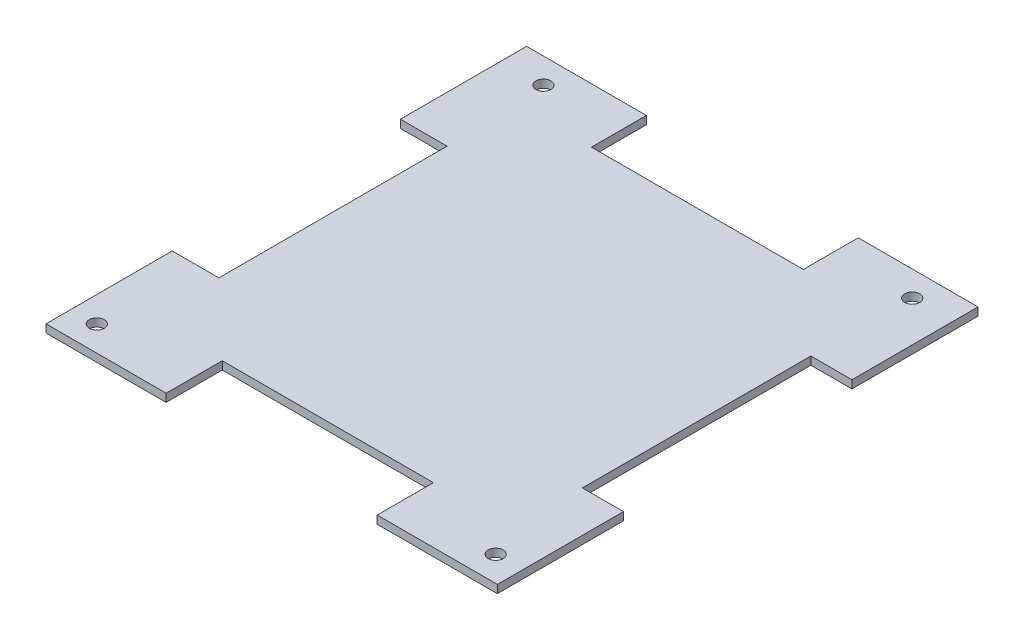
ISO-10303-21;
HEADER;
FILE_DESCRIPTION(('STEP AP214'),'2;1');
FILE_NAME('part.step','',(''),(''),'','','');
FILE_SCHEMA(('AUTOMOTIVE_DESIGN { 1 0 10303 214 1 1 1 1 }'));
ENDSEC;
DATA;
#1=APPLICATION_CONTEXT('core data for automotive mechanical design processes');
#2=APPLICATION_PROTOCOL_DEFINITION('international standard','automotive_design',2000,#1);
#3=PRODUCT_CONTEXT('',#1,'mechanical');
#4=PRODUCT('Part','Part','',(#3));
#5=PRODUCT_RELATED_PRODUCT_CATEGORY('part','',(#4));
#6=PRODUCT_DEFINITION_FORMATION('','',#4);
#7=PRODUCT_DEFINITION_CONTEXT('part definition',#1,'design');
#8=PRODUCT_DEFINITION('design','',#6,#7);
#9=PRODUCT_DEFINITION_SHAPE('','',#8);
#10=(LENGTH_UNIT() NAMED_UNIT(*) SI_UNIT(.MILLI.,.METRE.));
#11=(NAMED_UNIT(*) PLANE_ANGLE_UNIT() SI_UNIT($,.RADIAN.));
#12=(NAMED_UNIT(*) SI_UNIT($,.STERADIAN.) SOLID_ANGLE_UNIT());
#13=UNCERTAINTY_MEASURE_WITH_UNIT(LENGTH_MEASURE(1.E-05),#10,'distance_accuracy_value','');
#14=(GEOMETRIC_REPRESENTATION_CONTEXT(3) GLOBAL_UNCERTAINTY_ASSIGNED_CONTEXT((#13)) GLOBAL_UNIT_ASSIGNED_CONTEXT((#10,
#11,#12)) REPRESENTATION_CONTEXT('',''));
#15=CARTESIAN_POINT('',(0.,0.,0.));
#16=DIRECTION('',(0.,0.,1.));
#17=DIRECTION('',(1.,0.,0.));
#18=AXIS2_PLACEMENT_3D('',#15,#16,#17);
#19=CARTESIAN_POINT('',(0.,0.,2.54));
#20=DIRECTION('',(0.,0.,-1.));
#21=DIRECTION('',(-1.,0.,0.));
#22=AXIS2_PLACEMENT_3D('',#19,#20,#21);
#23=PLANE('',#22);
#24=DIRECTION('',(1.,0.,0.));
#25=VECTOR('',#24,1.);
#26=CARTESIAN_POINT('',(87.45,0.,2.54));
#27=LINE('',#26,#25);
#28=CARTESIAN_POINT('',(-2.59,0.,2.54));
#29=VERTEX_POINT('',#28);
#30=CARTESIAN_POINT('',(21.3706488480498,0.,2.54));
#31=VERTEX_POINT('',#30);
#32=EDGE_CURVE('E273',#29,#31,#27,.T.);
#33=ORIENTED_EDGE('',*,*,#32,.T.);
#34=DIRECTION('',(0.,1.,0.));
#35=VECTOR('',#34,1.);
#36=CARTESIAN_POINT('',(21.3706488480498,0.,2.54));
#37=LINE('',#36,#35);
#38=CARTESIAN_POINT('',(21.3706488480498,1.6,2.54));
#39=VERTEX_POINT('',#38);
#40=EDGE_CURVE('E11',#31,#39,#37,.T.);
#41=ORIENTED_EDGE('',*,*,#40,.T.);
#42=DIRECTION('',(-1.,0.,0.));
#43=VECTOR('',#42,1.);
#44=CARTESIAN_POINT('',(87.45,1.6,2.54));
#45=LINE('',#44,#43);
#46=CARTESIAN_POINT('',(-2.59,1.6,2.54));
#47=VERTEX_POINT('',#46);
#48=EDGE_CURVE('E266',#39,#47,#45,.T.);
#49=ORIENTED_EDGE('',*,*,#48,.T.);
#50=DIRECTION('',(0.,-1.,0.));
#51=VECTOR('',#50,1.);
#52=CARTESIAN_POINT('',(-2.59,1.6,2.54));
#53=LINE('',#52,#51);
#54=EDGE_CURVE('E270',#47,#29,#53,.T.);
#55=ORIENTED_EDGE('',*,*,#54,.T.);
#56=EDGE_LOOP('',(#33,#41,#49,#55));
#57=FACE_BOUND('',#56,.T.);
#58=ADVANCED_FACE('F36',(#57),#23,.F.);
#59=CARTESIAN_POINT('',(-2.59,0.,0.));
#60=DIRECTION('',(1.,0.,0.));
#61=DIRECTION('',(0.,0.,-1.));
#62=AXIS2_PLACEMENT_3D('',#59,#60,#61);
#63=PLANE('',#62);
#64=DIRECTION('',(0.,0.,1.));
#65=VECTOR('',#64,1.);
#66=CARTESIAN_POINT('',(-2.59,0.,-90.8));
#67=LINE('',#66,#65);
#68=CARTESIAN_POINT('',(-2.59,0.,-93.34));
#69=VERTEX_POINT('',#68);
#70=CARTESIAN_POINT('',(-2.59,0.,-68.1600542012034));
#71=VERTEX_POINT('',#70);
#72=EDGE_CURVE('E291',#69,#71,#67,.T.);
#73=ORIENTED_EDGE('',*,*,#72,.T.);
#74=DIRECTION('',(0.,1.,0.));
#75=VECTOR('',#74,1.);
#76=CARTESIAN_POINT('',(-2.59,0.,-68.1600542012034));
#77=LINE('',#76,#75);
#78=CARTESIAN_POINT('',(-2.59,1.6,-68.1600542012034));
#79=VERTEX_POINT('',#78);
#80=EDGE_CURVE('E342',#71,#79,#77,.T.);
#81=ORIENTED_EDGE('',*,*,#80,.T.);
#82=DIRECTION('',(0.,0.,-1.));
#83=VECTOR('',#82,1.);
#84=CARTESIAN_POINT('',(-2.59,1.6,-90.8));
#85=LINE('',#84,#83);
#86=CARTESIAN_POINT('',(-2.59,1.6,-93.34));
#87=VERTEX_POINT('',#86);
#88=EDGE_CURVE('E294',#79,#87,#85,.T.);
#89=ORIENTED_EDGE('',*,*,#88,.T.);
#90=DIRECTION('',(0.,1.,0.));
#91=VECTOR('',#90,1.);
#92=CARTESIAN_POINT('',(-2.59,0.,-93.34));
#93=LINE('',#92,#91);
#94=EDGE_CURVE('E276',#69,#87,#93,.T.);
#95=ORIENTED_EDGE('',*,*,#94,.F.);
#96=EDGE_LOOP('',(#73,#81,#89,#95));
#97=FACE_BOUND('',#96,.T.);
#98=ADVANCED_FACE('F375',(#97),#63,.F.);
#99=CARTESIAN_POINT('',(0.,0.,-93.34));
#100=DIRECTION('',(0.,0.,-1.));
#101=DIRECTION('',(-1.,0.,0.));
#102=AXIS2_PLACEMENT_3D('',#99,#100,#101);
#103=PLANE('',#102);
#104=DIRECTION('',(0.,1.,0.));
#105=VECTOR('',#104,1.);
#106=CARTESIAN_POINT('',(21.2967633827462,0.,-93.34));
#107=LINE('',#106,#105);
#108=CARTESIAN_POINT('',(21.2967633827462,0.,-93.34));
#109=VERTEX_POINT('',#108);
#110=CARTESIAN_POINT('',(21.2967633827462,1.6,-93.34));
#111=VERTEX_POINT('',#110);
#112=EDGE_CURVE('E338',#109,#111,#107,.T.);
#113=ORIENTED_EDGE('',*,*,#112,.F.);
#114=DIRECTION('',(-1.,0.,0.));
#115=VECTOR('',#114,1.);
#116=CARTESIAN_POINT('',(-2.59,0.,-93.34));
#117=LINE('',#116,#115);
#118=EDGE_CURVE('E286',#109,#69,#117,.T.);
#119=ORIENTED_EDGE('',*,*,#118,.T.);
#120=ORIENTED_EDGE('',*,*,#94,.T.);
#121=DIRECTION('',(1.,0.,0.));
#122=VECTOR('',#121,1.);
#123=CARTESIAN_POINT('',(-2.59,1.6,-93.34));
#124=LINE('',#123,#122);
#125=EDGE_CURVE('E280',#87,#111,#124,.T.);
#126=ORIENTED_EDGE('',*,*,#125,.T.);
#127=EDGE_LOOP('',(#113,#119,#120,#126));
#128=FACE_BOUND('',#127,.T.);
#129=ADVANCED_FACE('F379',(#128),#103,.T.);
#130=CARTESIAN_POINT('',(87.45,0.,0.));
#131=DIRECTION('',(-1.,0.,0.));
#132=DIRECTION('',(0.,0.,1.));
#133=AXIS2_PLACEMENT_3D('',#130,#131,#132);
#134=PLANE('',#133);
#135=DIRECTION('',(0.,0.,1.));
#136=VECTOR('',#135,1.);
#137=CARTESIAN_POINT('',(87.45,1.6,-90.8));
#138=LINE('',#137,#136);
#139=CARTESIAN_POINT('',(87.45,1.6,-93.34));
#140=VERTEX_POINT('',#139);
#141=CARTESIAN_POINT('',(87.45,1.6,-68.1857586213216));
#142=VERTEX_POINT('',#141);
#143=EDGE_CURVE('E299',#140,#142,#138,.T.);
#144=ORIENTED_EDGE('',*,*,#143,.T.);
#145=DIRECTION('',(0.,-1.,0.));
#146=VECTOR('',#145,1.);
#147=CARTESIAN_POINT('',(87.45,0.,-68.1857586213216));
#148=LINE('',#147,#146);
#149=CARTESIAN_POINT('',(87.45,0.,-68.1857586213216));
#150=VERTEX_POINT('',#149);
#151=EDGE_CURVE('E333',#142,#150,#148,.T.);
#152=ORIENTED_EDGE('',*,*,#151,.T.);
#153=DIRECTION('',(0.,0.,-1.));
#154=VECTOR('',#153,1.);
#155=CARTESIAN_POINT('',(87.45,0.,-90.8));
#156=LINE('',#155,#154);
#157=CARTESIAN_POINT('',(87.45,0.,-93.34));
#158=VERTEX_POINT('',#157);
#159=EDGE_CURVE('E302',#150,#158,#156,.T.);
#160=ORIENTED_EDGE('',*,*,#159,.T.);
#161=DIRECTION('',(0.,-1.,0.));
#162=VECTOR('',#161,1.);
#163=CARTESIAN_POINT('',(87.45,0.,-93.34));
#164=LINE('',#163,#162);
#165=EDGE_CURVE('E283',#140,#158,#164,.T.);
#166=ORIENTED_EDGE('',*,*,#165,.F.);
#167=EDGE_LOOP('',(#144,#152,#160,#166));
#168=FACE_BOUND('',#167,.T.);
#169=ADVANCED_FACE('F400',(#168),#134,.F.);
#170=CARTESIAN_POINT('',(0.,1.6,0.));
#171=DIRECTION('',(0.,-1.,0.));
#172=DIRECTION('',(0.,0.,-1.));
#173=AXIS2_PLACEMENT_3D('',#170,#171,#172);
#174=PLANE('',#173);
#175=CARTESIAN_POINT('',(79.37,1.6,-88.3));
#176=DIRECTION('',(0.,1.,0.));
#177=DIRECTION('',(0.,0.,1.));
#178=AXIS2_PLACEMENT_3D('',#175,#176,#177);
#179=CIRCLE('',#178,1.5);
#180=CARTESIAN_POINT('',(79.37,1.6,-86.8));
#181=VERTEX_POINT('',#180);
#182=EDGE_CURVE('E306',#181,#181,#179,.T.);
#183=ORIENTED_EDGE('',*,*,#182,.F.);
#184=EDGE_LOOP('',(#183));
#185=FACE_BOUND('',#184,.T.);
#186=CARTESIAN_POINT('',(5.8,1.6,-88.3));
#187=DIRECTION('',(0.,1.,0.));
#188=DIRECTION('',(0.,0.,1.));
#189=AXIS2_PLACEMENT_3D('',#186,#187,#188);
#190=CIRCLE('',#189,1.5);
#191=CARTESIAN_POINT('',(5.8,1.6,-86.8));
#192=VERTEX_POINT('',#191);
#193=EDGE_CURVE('E310',#192,#192,#190,.T.);
#194=ORIENTED_EDGE('',*,*,#193,.F.);
#195=EDGE_LOOP('',(#194));
#196=FACE_BOUND('',#195,.T.);
#197=CARTESIAN_POINT('',(82.07,1.6,-2.5));
#198=DIRECTION('',(0.,1.,0.));
#199=DIRECTION('',(0.,0.,1.));
#200=AXIS2_PLACEMENT_3D('',#197,#198,#199);
#201=CIRCLE('',#200,1.5);
#202=CARTESIAN_POINT('',(82.07,1.6,-1.));
#203=VERTEX_POINT('',#202);
#204=EDGE_CURVE('E316',#203,#203,#201,.T.);
#205=ORIENTED_EDGE('',*,*,#204,.F.);
#206=EDGE_LOOP('',(#205));
#207=FACE_BOUND('',#206,.T.);
#208=CARTESIAN_POINT('',(2.5,1.6,-2.5));
#209=DIRECTION('',(0.,1.,0.));
#210=DIRECTION('',(0.,0.,1.));
#211=AXIS2_PLACEMENT_3D('',#208,#209,#210);
#212=CIRCLE('',#211,1.5);
#213=CARTESIAN_POINT('',(2.5,1.6,-1.));
#214=VERTEX_POINT('',#213);
#215=EDGE_CURVE('E322',#214,#214,#212,.T.);
#216=ORIENTED_EDGE('',*,*,#215,.F.);
#217=EDGE_LOOP('',(#216));
#218=FACE_BOUND('',#217,.T.);
#219=ORIENTED_EDGE('',*,*,#48,.F.);
#220=DIRECTION('',(0.,0.,1.));
#221=VECTOR('',#220,1.);
#222=CARTESIAN_POINT('',(21.3706488480498,1.6,-8.66006941402019));
#223=LINE('',#222,#221);
#224=CARTESIAN_POINT('',(21.3706488480498,1.6,-8.66006941402019));
#225=VERTEX_POINT('',#224);
#226=EDGE_CURVE('E197',#225,#39,#223,.T.);
#227=ORIENTED_EDGE('',*,*,#226,.F.);
#228=DIRECTION('',(-1.,0.,0.));
#229=VECTOR('',#228,1.);
#230=CARTESIAN_POINT('',(63.4893511519502,1.6,-8.6600694140202));
#231=LINE('',#230,#229);
#232=CARTESIAN_POINT('',(63.4893511519502,1.6,-8.6600694140202));
#233=VERTEX_POINT('',#232);
#234=EDGE_CURVE('E194',#233,#225,#231,.T.);
#235=ORIENTED_EDGE('',*,*,#234,.F.);
#236=DIRECTION('',(0.,0.,-1.));
#237=VECTOR('',#236,1.);
#238=CARTESIAN_POINT('',(63.4893511519502,1.6,-8.6600694140202));
#239=LINE('',#238,#237);
#240=CARTESIAN_POINT('',(63.4893511519502,1.6,2.54));
#241=VERTEX_POINT('',#240);
#242=EDGE_CURVE('E175',#241,#233,#239,.T.);
#243=ORIENTED_EDGE('',*,*,#242,.F.);
#244=CARTESIAN_POINT('',(87.45,1.6,2.54));
#245=VERTEX_POINT('',#244);
#246=EDGE_CURVE('E267',#245,#241,#45,.T.);
#247=ORIENTED_EDGE('',*,*,#246,.F.);
#248=CARTESIAN_POINT('',(87.45,1.6,-22.6142413786784));
#249=VERTEX_POINT('',#248);
#250=EDGE_CURVE('E298',#249,#245,#138,.T.);
#251=ORIENTED_EDGE('',*,*,#250,.F.);
#252=DIRECTION('',(1.,0.,0.));
#253=VECTOR('',#252,1.);
#254=CARTESIAN_POINT('',(95.6363214880288,1.6,-22.6142413786784));
#255=LINE('',#254,#253);
#256=CARTESIAN_POINT('',(79.2636785119712,1.6,-22.6142413786784));
#257=VERTEX_POINT('',#256);
#258=EDGE_CURVE('E256',#257,#249,#255,.T.);
#259=ORIENTED_EDGE('',*,*,#258,.F.);
#260=DIRECTION('',(0.,0.,1.));
#261=VECTOR('',#260,1.);
#262=CARTESIAN_POINT('',(79.2636785119711,1.6,-68.1857586213216));
#263=LINE('',#262,#261);
#264=CARTESIAN_POINT('',(79.2636785119711,1.6,-68.1857586213216));
#265=VERTEX_POINT('',#264);
#266=EDGE_CURVE('E240',#265,#257,#263,.T.);
#267=ORIENTED_EDGE('',*,*,#266,.F.);
#268=DIRECTION('',(-1.,0.,0.));
#269=VECTOR('',#268,1.);
#270=CARTESIAN_POINT('',(95.6363214880288,1.6,-68.1857586213216));
#271=LINE('',#270,#269);
#272=EDGE_CURVE('E247',#142,#265,#271,.T.);
#273=ORIENTED_EDGE('',*,*,#272,.F.);
#274=ORIENTED_EDGE('',*,*,#143,.F.);
#275=CARTESIAN_POINT('',(63.5632366172538,1.6,-93.34));
#276=VERTEX_POINT('',#275);
#277=EDGE_CURVE('E279',#276,#140,#124,.T.);
#278=ORIENTED_EDGE('',*,*,#277,.F.);
#279=DIRECTION('',(0.,0.,-1.));
#280=VECTOR('',#279,1.);
#281=CARTESIAN_POINT('',(63.5632366172538,1.6,-104.290532807686));
#282=LINE('',#281,#280);
#283=CARTESIAN_POINT('',(63.5632366172538,1.6,-82.3894671923142));
#284=VERTEX_POINT('',#283);
#285=EDGE_CURVE('E226',#284,#276,#282,.T.);
#286=ORIENTED_EDGE('',*,*,#285,.F.);
#287=DIRECTION('',(1.,0.,0.));
#288=VECTOR('',#287,1.);
#289=CARTESIAN_POINT('',(63.5632366172538,1.6,-82.3894671923142));
#290=LINE('',#289,#288);
#291=CARTESIAN_POINT('',(21.2967633827462,1.6,-82.3894671923142));
#292=VERTEX_POINT('',#291);
#293=EDGE_CURVE('E234',#292,#284,#290,.T.);
#294=ORIENTED_EDGE('',*,*,#293,.F.);
#295=DIRECTION('',(0.,0.,1.));
#296=VECTOR('',#295,1.);
#297=CARTESIAN_POINT('',(21.2967633827462,1.6,-104.290532807686));
#298=LINE('',#297,#296);
#299=EDGE_CURVE('E219',#111,#292,#298,.T.);
#300=ORIENTED_EDGE('',*,*,#299,.F.);
#301=ORIENTED_EDGE('',*,*,#125,.F.);
#302=ORIENTED_EDGE('',*,*,#88,.F.);
#303=DIRECTION('',(-1.,0.,0.));
#304=VECTOR('',#303,1.);
#305=CARTESIAN_POINT('',(6.71850682793007,1.6,-68.1600542012034));
#306=LINE('',#305,#304);
#307=CARTESIAN_POINT('',(6.71850682793007,1.6,-68.1600542012034));
#308=VERTEX_POINT('',#307);
#309=EDGE_CURVE('E205',#308,#79,#306,.T.);
#310=ORIENTED_EDGE('',*,*,#309,.F.);
#311=DIRECTION('',(0.,0.,-1.));
#312=VECTOR('',#311,1.);
#313=CARTESIAN_POINT('',(6.71850682793007,1.6,-68.1600542012034));
#314=LINE('',#313,#312);
#315=CARTESIAN_POINT('',(6.71850682793007,1.6,-22.6399457987966));
#316=VERTEX_POINT('',#315);
#317=EDGE_CURVE('E213',#316,#308,#314,.T.);
#318=ORIENTED_EDGE('',*,*,#317,.F.);
#319=DIRECTION('',(1.,0.,0.));
#320=VECTOR('',#319,1.);
#321=CARTESIAN_POINT('',(6.71850682793007,1.6,-22.6399457987966));
#322=LINE('',#321,#320);
#323=CARTESIAN_POINT('',(-2.59,1.6,-22.6399457987966));
#324=VERTEX_POINT('',#323);
#325=EDGE_CURVE('E201',#324,#316,#322,.T.);
#326=ORIENTED_EDGE('',*,*,#325,.F.);
#327=EDGE_CURVE('E295',#47,#324,#85,.T.);
#328=ORIENTED_EDGE('',*,*,#327,.F.);
#329=EDGE_LOOP('',(#219,#227,#235,#243,#247,#251,#259,#267,#273,#274,#278,#286,#294,#300,#301,
#302,#310,#318,#326,#328));
#330=FACE_BOUND('',#329,.T.);
#331=ADVANCED_FACE('F349',(#185,#196,#207,#218,#330),#174,.F.);
#332=CARTESIAN_POINT('',(0.,0.,0.));
#333=DIRECTION('',(0.,-1.,0.));
#334=DIRECTION('',(0.,0.,-1.));
#335=AXIS2_PLACEMENT_3D('',#332,#333,#334);
#336=PLANE('',#335);
#337=DIRECTION('',(0.,0.,1.));
#338=VECTOR('',#337,1.);
#339=CARTESIAN_POINT('',(21.3706488480498,0.,-8.66006941402019));
#340=LINE('',#339,#338);
#341=CARTESIAN_POINT('',(21.3706488480498,0.,-8.66006941402019));
#342=VERTEX_POINT('',#341);
#343=EDGE_CURVE('E192',#342,#31,#340,.T.);
#344=ORIENTED_EDGE('',*,*,#343,.T.);
#345=ORIENTED_EDGE('',*,*,#32,.F.);
#346=CARTESIAN_POINT('',(-2.59,0.,-22.6399457987966));
#347=VERTEX_POINT('',#346);
#348=EDGE_CURVE('E290',#347,#29,#67,.T.);
#349=ORIENTED_EDGE('',*,*,#348,.F.);
#350=DIRECTION('',(1.,0.,0.));
#351=VECTOR('',#350,1.);
#352=CARTESIAN_POINT('',(6.71850682793007,0.,-22.6399457987966));
#353=LINE('',#352,#351);
#354=CARTESIAN_POINT('',(6.71850682793007,0.,-22.6399457987966));
#355=VERTEX_POINT('',#354);
#356=EDGE_CURVE('E59',#347,#355,#353,.T.);
#357=ORIENTED_EDGE('',*,*,#356,.T.);
#358=DIRECTION('',(0.,0.,-1.));
#359=VECTOR('',#358,1.);
#360=CARTESIAN_POINT('',(6.71850682793007,0.,-68.1600542012034));
#361=LINE('',#360,#359);
#362=CARTESIAN_POINT('',(6.71850682793007,0.,-68.1600542012034));
#363=VERTEX_POINT('',#362);
#364=EDGE_CURVE('E204',#355,#363,#361,.T.);
#365=ORIENTED_EDGE('',*,*,#364,.T.);
#366=DIRECTION('',(-1.,0.,0.));
#367=VECTOR('',#366,1.);
#368=CARTESIAN_POINT('',(6.71850682793007,0.,-68.1600542012034));
#369=LINE('',#368,#367);
#370=EDGE_CURVE('E208',#363,#71,#369,.T.);
#371=ORIENTED_EDGE('',*,*,#370,.T.);
#372=ORIENTED_EDGE('',*,*,#72,.F.);
#373=ORIENTED_EDGE('',*,*,#118,.F.);
#374=DIRECTION('',(0.,0.,1.));
#375=VECTOR('',#374,1.);
#376=CARTESIAN_POINT('',(21.2967633827462,0.,-104.290532807686));
#377=LINE('',#376,#375);
#378=CARTESIAN_POINT('',(21.2967633827462,0.,-82.3894671923142));
#379=VERTEX_POINT('',#378);
#380=EDGE_CURVE('E222',#109,#379,#377,.T.);
#381=ORIENTED_EDGE('',*,*,#380,.T.);
#382=DIRECTION('',(1.,0.,0.));
#383=VECTOR('',#382,1.);
#384=CARTESIAN_POINT('',(63.5632366172538,0.,-82.3894671923142));
#385=LINE('',#384,#383);
#386=CARTESIAN_POINT('',(63.5632366172538,0.,-82.3894671923142));
#387=VERTEX_POINT('',#386);
#388=EDGE_CURVE('E225',#379,#387,#385,.T.);
#389=ORIENTED_EDGE('',*,*,#388,.T.);
#390=DIRECTION('',(0.,0.,-1.));
#391=VECTOR('',#390,1.);
#392=CARTESIAN_POINT('',(63.5632366172538,0.,-104.290532807686));
#393=LINE('',#392,#391);
#394=CARTESIAN_POINT('',(63.5632366172538,0.,-93.34));
#395=VERTEX_POINT('',#394);
#396=EDGE_CURVE('E229',#387,#395,#393,.T.);
#397=ORIENTED_EDGE('',*,*,#396,.T.);
#398=EDGE_CURVE('E287',#158,#395,#117,.T.);
#399=ORIENTED_EDGE('',*,*,#398,.F.);
#400=ORIENTED_EDGE('',*,*,#159,.F.);
#401=DIRECTION('',(-1.,0.,0.));
#402=VECTOR('',#401,1.);
#403=CARTESIAN_POINT('',(95.6363214880288,0.,-68.1857586213216));
#404=LINE('',#403,#402);
#405=CARTESIAN_POINT('',(79.2636785119711,0.,-68.1857586213216));
#406=VERTEX_POINT('',#405);
#407=EDGE_CURVE('E250',#150,#406,#404,.T.);
#408=ORIENTED_EDGE('',*,*,#407,.T.);
#409=DIRECTION('',(0.,0.,1.));
#410=VECTOR('',#409,1.);
#411=CARTESIAN_POINT('',(79.2636785119711,0.,-68.1857586213216));
#412=LINE('',#411,#410);
#413=CARTESIAN_POINT('',(79.2636785119712,0.,-22.6142413786784));
#414=VERTEX_POINT('',#413);
#415=EDGE_CURVE('E243',#406,#414,#412,.T.);
#416=ORIENTED_EDGE('',*,*,#415,.T.);
#417=DIRECTION('',(1.,0.,0.));
#418=VECTOR('',#417,1.);
#419=CARTESIAN_POINT('',(95.6363214880288,0.,-22.6142413786784));
#420=LINE('',#419,#418);
#421=CARTESIAN_POINT('',(87.45,0.,-22.6142413786784));
#422=VERTEX_POINT('',#421);
#423=EDGE_CURVE('E246',#414,#422,#420,.T.);
#424=ORIENTED_EDGE('',*,*,#423,.T.);
#425=CARTESIAN_POINT('',(87.45,0.,2.54));
#426=VERTEX_POINT('',#425);
#427=EDGE_CURVE('E303',#426,#422,#156,.T.);
#428=ORIENTED_EDGE('',*,*,#427,.F.);
#429=CARTESIAN_POINT('',(63.4893511519502,0.,2.54));
#430=VERTEX_POINT('',#429);
#431=EDGE_CURVE('E191',#430,#426,#27,.T.);
#432=ORIENTED_EDGE('',*,*,#431,.F.);
#433=DIRECTION('',(0.,0.,-1.));
#434=VECTOR('',#433,1.);
#435=CARTESIAN_POINT('',(63.4893511519502,0.,-8.6600694140202));
#436=LINE('',#435,#434);
#437=CARTESIAN_POINT('',(63.4893511519502,0.,-8.6600694140202));
#438=VERTEX_POINT('',#437);
#439=EDGE_CURVE('E51',#430,#438,#436,.T.);
#440=ORIENTED_EDGE('',*,*,#439,.T.);
#441=DIRECTION('',(-1.,0.,0.));
#442=VECTOR('',#441,1.);
#443=CARTESIAN_POINT('',(63.4893511519502,0.,-8.6600694140202));
#444=LINE('',#443,#442);
#445=EDGE_CURVE('E180',#438,#342,#444,.T.);
#446=ORIENTED_EDGE('',*,*,#445,.T.);
#447=EDGE_LOOP('',(#344,#345,#349,#357,#365,#371,#372,#373,#381,#389,#397,#399,#400,#408,#416,
#424,#428,#432,#440,#446));
#448=FACE_BOUND('',#447,.T.);
#449=CARTESIAN_POINT('',(79.37,0.,-88.3));
#450=DIRECTION('',(0.,1.,0.));
#451=DIRECTION('',(0.,0.,1.));
#452=AXIS2_PLACEMENT_3D('',#449,#450,#451);
#453=CIRCLE('',#452,1.5);
#454=CARTESIAN_POINT('',(79.37,0.,-86.8));
#455=VERTEX_POINT('',#454);
#456=EDGE_CURVE('E307',#455,#455,#453,.T.);
#457=ORIENTED_EDGE('',*,*,#456,.T.);
#458=EDGE_LOOP('',(#457));
#459=FACE_BOUND('',#458,.T.);
#460=CARTESIAN_POINT('',(5.8,0.,-88.3));
#461=DIRECTION('',(0.,1.,0.));
#462=DIRECTION('',(0.,0.,1.));
#463=AXIS2_PLACEMENT_3D('',#460,#461,#462);
#464=CIRCLE('',#463,1.5);
#465=CARTESIAN_POINT('',(5.8,0.,-86.8));
#466=VERTEX_POINT('',#465);
#467=EDGE_CURVE('E313',#466,#466,#464,.T.);
#468=ORIENTED_EDGE('',*,*,#467,.T.);
#469=EDGE_LOOP('',(#468));
#470=FACE_BOUND('',#469,.T.);
#471=CARTESIAN_POINT('',(82.07,0.,-2.5));
#472=DIRECTION('',(0.,1.,0.));
#473=DIRECTION('',(0.,0.,1.));
#474=AXIS2_PLACEMENT_3D('',#471,#472,#473);
#475=CIRCLE('',#474,1.5);
#476=CARTESIAN_POINT('',(82.07,0.,-1.));
#477=VERTEX_POINT('',#476);
#478=EDGE_CURVE('E319',#477,#477,#475,.T.);
#479=ORIENTED_EDGE('',*,*,#478,.T.);
#480=EDGE_LOOP('',(#479));
#481=FACE_BOUND('',#480,.T.);
#482=CARTESIAN_POINT('',(2.5,0.,-2.5));
#483=DIRECTION('',(0.,1.,0.));
#484=DIRECTION('',(0.,0.,1.));
#485=AXIS2_PLACEMENT_3D('',#482,#483,#484);
#486=CIRCLE('',#485,1.5);
#487=CARTESIAN_POINT('',(2.5,0.,-1.));
#488=VERTEX_POINT('',#487);
#489=EDGE_CURVE('E325',#488,#488,#486,.T.);
#490=ORIENTED_EDGE('',*,*,#489,.T.);
#491=EDGE_LOOP('',(#490));
#492=FACE_BOUND('',#491,.T.);
#493=ADVANCED_FACE('F38',(#448,#459,#470,#481,#492),#336,.T.);
#494=CARTESIAN_POINT('',(2.5,0.,-2.5));
#495=DIRECTION('',(0.,1.,0.));
#496=DIRECTION('',(0.,0.,1.));
#497=AXIS2_PLACEMENT_3D('',#494,#495,#496);
#498=CYLINDRICAL_SURFACE('',#497,1.5);
#499=ORIENTED_EDGE('',*,*,#489,.F.);
#500=EDGE_LOOP('',(#499));
#501=FACE_BOUND('',#500,.T.);
#502=ORIENTED_EDGE('',*,*,#215,.T.);
#503=EDGE_LOOP('',(#502));
#504=FACE_BOUND('',#503,.T.);
#505=ADVANCED_FACE('F463',(#501,#504),#498,.F.);
#506=CARTESIAN_POINT('',(82.07,0.,-2.5));
#507=DIRECTION('',(0.,1.,0.));
#508=DIRECTION('',(0.,0.,1.));
#509=AXIS2_PLACEMENT_3D('',#506,#507,#508);
#510=CYLINDRICAL_SURFACE('',#509,1.5);
#511=ORIENTED_EDGE('',*,*,#478,.F.);
#512=EDGE_LOOP('',(#511));
#513=FACE_BOUND('',#512,.T.);
#514=ORIENTED_EDGE('',*,*,#204,.T.);
#515=EDGE_LOOP('',(#514));
#516=FACE_BOUND('',#515,.T.);
#517=ADVANCED_FACE('F469',(#513,#516),#510,.F.);
#518=CARTESIAN_POINT('',(5.8,0.,-88.3));
#519=DIRECTION('',(0.,1.,0.));
#520=DIRECTION('',(0.,0.,1.));
#521=AXIS2_PLACEMENT_3D('',#518,#519,#520);
#522=CYLINDRICAL_SURFACE('',#521,1.5);
#523=ORIENTED_EDGE('',*,*,#467,.F.);
#524=EDGE_LOOP('',(#523));
#525=FACE_BOUND('',#524,.T.);
#526=ORIENTED_EDGE('',*,*,#193,.T.);
#527=EDGE_LOOP('',(#526));
#528=FACE_BOUND('',#527,.T.);
#529=ADVANCED_FACE('F423',(#525,#528),#522,.F.);
#530=CARTESIAN_POINT('',(79.37,0.,-88.3));
#531=DIRECTION('',(0.,1.,0.));
#532=DIRECTION('',(0.,0.,1.));
#533=AXIS2_PLACEMENT_3D('',#530,#531,#532);
#534=CYLINDRICAL_SURFACE('',#533,1.5);
#535=ORIENTED_EDGE('',*,*,#456,.F.);
#536=EDGE_LOOP('',(#535));
#537=FACE_BOUND('',#536,.T.);
#538=ORIENTED_EDGE('',*,*,#182,.T.);
#539=EDGE_LOOP('',(#538));
#540=FACE_BOUND('',#539,.T.);
#541=ADVANCED_FACE('F416',(#537,#540),#534,.F.);
#542=ORIENTED_EDGE('',*,*,#427,.T.);
#543=DIRECTION('',(0.,1.,0.));
#544=VECTOR('',#543,1.);
#545=CARTESIAN_POINT('',(87.45,0.,-22.6142413786784));
#546=LINE('',#545,#544);
#547=EDGE_CURVE('E328',#422,#249,#546,.T.);
#548=ORIENTED_EDGE('',*,*,#547,.T.);
#549=ORIENTED_EDGE('',*,*,#250,.T.);
#550=DIRECTION('',(0.,1.,0.));
#551=VECTOR('',#550,1.);
#552=CARTESIAN_POINT('',(87.45,1.6,2.54));
#553=LINE('',#552,#551);
#554=EDGE_CURVE('E262',#426,#245,#553,.T.);
#555=ORIENTED_EDGE('',*,*,#554,.F.);
#556=EDGE_LOOP('',(#542,#548,#549,#555));
#557=FACE_BOUND('',#556,.T.);
#558=ADVANCED_FACE('F414',(#557),#134,.F.);
#559=ORIENTED_EDGE('',*,*,#327,.T.);
#560=DIRECTION('',(0.,-1.,0.));
#561=VECTOR('',#560,1.);
#562=CARTESIAN_POINT('',(-2.59,0.,-22.6399457987966));
#563=LINE('',#562,#561);
#564=EDGE_CURVE('E340',#324,#347,#563,.T.);
#565=ORIENTED_EDGE('',*,*,#564,.T.);
#566=ORIENTED_EDGE('',*,*,#348,.T.);
#567=ORIENTED_EDGE('',*,*,#54,.F.);
#568=EDGE_LOOP('',(#559,#565,#566,#567));
#569=FACE_BOUND('',#568,.T.);
#570=ADVANCED_FACE('F360',(#569),#63,.F.);
#571=DIRECTION('',(0.,-1.,0.));
#572=VECTOR('',#571,1.);
#573=CARTESIAN_POINT('',(63.5632366172538,0.,-93.34));
#574=LINE('',#573,#572);
#575=EDGE_CURVE('E336',#276,#395,#574,.T.);
#576=ORIENTED_EDGE('',*,*,#575,.F.);
#577=ORIENTED_EDGE('',*,*,#277,.T.);
#578=ORIENTED_EDGE('',*,*,#165,.T.);
#579=ORIENTED_EDGE('',*,*,#398,.T.);
#580=EDGE_LOOP('',(#576,#577,#578,#579));
#581=FACE_BOUND('',#580,.T.);
#582=ADVANCED_FACE('F395',(#581),#103,.T.);
#583=ORIENTED_EDGE('',*,*,#246,.T.);
#584=DIRECTION('',(0.,-1.,0.));
#585=VECTOR('',#584,1.);
#586=CARTESIAN_POINT('',(63.4893511519502,0.,2.54));
#587=LINE('',#586,#585);
#588=EDGE_CURVE('E44',#241,#430,#587,.T.);
#589=ORIENTED_EDGE('',*,*,#588,.T.);
#590=ORIENTED_EDGE('',*,*,#431,.T.);
#591=ORIENTED_EDGE('',*,*,#554,.T.);
#592=EDGE_LOOP('',(#583,#589,#590,#591));
#593=FACE_BOUND('',#592,.T.);
#594=ADVANCED_FACE('F345',(#593),#23,.F.);
#595=CARTESIAN_POINT('',(95.6363214880288,0.,-68.1857586213216));
#596=DIRECTION('',(0.,0.,-1.));
#597=DIRECTION('',(-1.,0.,0.));
#598=AXIS2_PLACEMENT_3D('',#595,#596,#597);
#599=PLANE('',#598);
#600=ORIENTED_EDGE('',*,*,#272,.T.);
#601=DIRECTION('',(0.,1.,0.));
#602=VECTOR('',#601,1.);
#603=CARTESIAN_POINT('',(79.2636785119711,0.,-68.1857586213216));
#604=LINE('',#603,#602);
#605=EDGE_CURVE('E259',#406,#265,#604,.T.);
#606=ORIENTED_EDGE('',*,*,#605,.F.);
#607=ORIENTED_EDGE('',*,*,#407,.F.);
#608=ORIENTED_EDGE('',*,*,#151,.F.);
#609=EDGE_LOOP('',(#600,#606,#607,#608));
#610=FACE_BOUND('',#609,.T.);
#611=ADVANCED_FACE('F403',(#610),#599,.F.);
#612=CARTESIAN_POINT('',(95.6363214880288,0.,-22.6142413786784));
#613=DIRECTION('',(0.,0.,1.));
#614=DIRECTION('',(1.,0.,0.));
#615=AXIS2_PLACEMENT_3D('',#612,#613,#614);
#616=PLANE('',#615);
#617=ORIENTED_EDGE('',*,*,#423,.F.);
#618=DIRECTION('',(0.,1.,0.));
#619=VECTOR('',#618,1.);
#620=CARTESIAN_POINT('',(79.2636785119712,0.,-22.6142413786784));
#621=LINE('',#620,#619);
#622=EDGE_CURVE('E253',#414,#257,#621,.T.);
#623=ORIENTED_EDGE('',*,*,#622,.T.);
#624=ORIENTED_EDGE('',*,*,#258,.T.);
#625=ORIENTED_EDGE('',*,*,#547,.F.);
#626=EDGE_LOOP('',(#617,#623,#624,#625));
#627=FACE_BOUND('',#626,.T.);
#628=ADVANCED_FACE('F411',(#627),#616,.F.);
#629=CARTESIAN_POINT('',(79.2636785119711,0.,-68.1857586213216));
#630=DIRECTION('',(-1.,0.,0.));
#631=DIRECTION('',(0.,0.,1.));
#632=AXIS2_PLACEMENT_3D('',#629,#630,#631);
#633=PLANE('',#632);
#634=ORIENTED_EDGE('',*,*,#266,.T.);
#635=ORIENTED_EDGE('',*,*,#622,.F.);
#636=ORIENTED_EDGE('',*,*,#415,.F.);
#637=ORIENTED_EDGE('',*,*,#605,.T.);
#638=EDGE_LOOP('',(#634,#635,#636,#637));
#639=FACE_BOUND('',#638,.T.);
#640=ADVANCED_FACE('F407',(#639),#633,.F.);
#641=CARTESIAN_POINT('',(21.2967633827462,0.,-104.290532807686));
#642=DIRECTION('',(-1.,0.,0.));
#643=DIRECTION('',(0.,0.,1.));
#644=AXIS2_PLACEMENT_3D('',#641,#642,#643);
#645=PLANE('',#644);
#646=ORIENTED_EDGE('',*,*,#112,.T.);
#647=ORIENTED_EDGE('',*,*,#299,.T.);
#648=DIRECTION('',(0.,1.,0.));
#649=VECTOR('',#648,1.);
#650=CARTESIAN_POINT('',(21.2967633827462,0.,-82.3894671923142));
#651=LINE('',#650,#649);
#652=EDGE_CURVE('E232',#379,#292,#651,.T.);
#653=ORIENTED_EDGE('',*,*,#652,.F.);
#654=ORIENTED_EDGE('',*,*,#380,.F.);
#655=EDGE_LOOP('',(#646,#647,#653,#654));
#656=FACE_BOUND('',#655,.T.);
#657=ADVANCED_FACE('F382',(#656),#645,.F.);
#658=CARTESIAN_POINT('',(63.5632366172538,0.,-104.290532807686));
#659=DIRECTION('',(1.,0.,0.));
#660=DIRECTION('',(0.,0.,-1.));
#661=AXIS2_PLACEMENT_3D('',#658,#659,#660);
#662=PLANE('',#661);
#663=ORIENTED_EDGE('',*,*,#575,.T.);
#664=ORIENTED_EDGE('',*,*,#396,.F.);
#665=DIRECTION('',(0.,1.,0.));
#666=VECTOR('',#665,1.);
#667=CARTESIAN_POINT('',(63.5632366172538,0.,-82.3894671923142));
#668=LINE('',#667,#666);
#669=EDGE_CURVE('E238',#387,#284,#668,.T.);
#670=ORIENTED_EDGE('',*,*,#669,.T.);
#671=ORIENTED_EDGE('',*,*,#285,.T.);
#672=EDGE_LOOP('',(#663,#664,#670,#671));
#673=FACE_BOUND('',#672,.T.);
#674=ADVANCED_FACE('F390',(#673),#662,.F.);
#675=CARTESIAN_POINT('',(63.5632366172538,0.,-82.3894671923142));
#676=DIRECTION('',(0.,0.,1.));
#677=DIRECTION('',(1.,0.,0.));
#678=AXIS2_PLACEMENT_3D('',#675,#676,#677);
#679=PLANE('',#678);
#680=ORIENTED_EDGE('',*,*,#293,.T.);
#681=ORIENTED_EDGE('',*,*,#669,.F.);
#682=ORIENTED_EDGE('',*,*,#388,.F.);
#683=ORIENTED_EDGE('',*,*,#652,.T.);
#684=EDGE_LOOP('',(#680,#681,#682,#683));
#685=FACE_BOUND('',#684,.T.);
#686=ADVANCED_FACE('F386',(#685),#679,.F.);
#687=CARTESIAN_POINT('',(6.71850682793007,0.,-68.1600542012034));
#688=DIRECTION('',(0.,0.,-1.));
#689=DIRECTION('',(-1.,0.,0.));
#690=AXIS2_PLACEMENT_3D('',#687,#688,#689);
#691=PLANE('',#690);
#692=ORIENTED_EDGE('',*,*,#370,.F.);
#693=DIRECTION('',(0.,1.,0.));
#694=VECTOR('',#693,1.);
#695=CARTESIAN_POINT('',(6.71850682793007,0.,-68.1600542012034));
#696=LINE('',#695,#694);
#697=EDGE_CURVE('E217',#363,#308,#696,.T.);
#698=ORIENTED_EDGE('',*,*,#697,.T.);
#699=ORIENTED_EDGE('',*,*,#309,.T.);
#700=ORIENTED_EDGE('',*,*,#80,.F.);
#701=EDGE_LOOP('',(#692,#698,#699,#700));
#702=FACE_BOUND('',#701,.T.);
#703=ADVANCED_FACE('F623',(#702),#691,.F.);
#704=CARTESIAN_POINT('',(6.71850682793007,0.,-22.6399457987966));
#705=DIRECTION('',(0.,0.,1.));
#706=DIRECTION('',(1.,0.,0.));
#707=AXIS2_PLACEMENT_3D('',#704,#705,#706);
#708=PLANE('',#707);
#709=ORIENTED_EDGE('',*,*,#325,.T.);
#710=DIRECTION('',(0.,1.,0.));
#711=VECTOR('',#710,1.);
#712=CARTESIAN_POINT('',(6.71850682793007,0.,-22.6399457987966));
#713=LINE('',#712,#711);
#714=EDGE_CURVE('E211',#355,#316,#713,.T.);
#715=ORIENTED_EDGE('',*,*,#714,.F.);
#716=ORIENTED_EDGE('',*,*,#356,.F.);
#717=ORIENTED_EDGE('',*,*,#564,.F.);
#718=EDGE_LOOP('',(#709,#715,#716,#717));
#719=FACE_BOUND('',#718,.T.);
#720=ADVANCED_FACE('F362',(#719),#708,.F.);
#721=CARTESIAN_POINT('',(6.71850682793007,0.,-68.1600542012034));
#722=DIRECTION('',(1.,0.,0.));
#723=DIRECTION('',(0.,0.,-1.));
#724=AXIS2_PLACEMENT_3D('',#721,#722,#723);
#725=PLANE('',#724);
#726=ORIENTED_EDGE('',*,*,#317,.T.);
#727=ORIENTED_EDGE('',*,*,#697,.F.);
#728=ORIENTED_EDGE('',*,*,#364,.F.);
#729=ORIENTED_EDGE('',*,*,#714,.T.);
#730=EDGE_LOOP('',(#726,#727,#728,#729));
#731=FACE_BOUND('',#730,.T.);
#732=ADVANCED_FACE('F367',(#731),#725,.F.);
#733=CARTESIAN_POINT('',(21.3706488480498,0.,-8.66006941402019));
#734=DIRECTION('',(-1.,0.,0.));
#735=DIRECTION('',(0.,0.,1.));
#736=AXIS2_PLACEMENT_3D('',#733,#734,#735);
#737=PLANE('',#736);
#738=ORIENTED_EDGE('',*,*,#343,.F.);
#739=DIRECTION('',(0.,1.,0.));
#740=VECTOR('',#739,1.);
#741=CARTESIAN_POINT('',(21.3706488480498,0.,-8.66006941402019));
#742=LINE('',#741,#740);
#743=EDGE_CURVE('E179',#342,#225,#742,.T.);
#744=ORIENTED_EDGE('',*,*,#743,.T.);
#745=ORIENTED_EDGE('',*,*,#226,.T.);
#746=ORIENTED_EDGE('',*,*,#40,.F.);
#747=EDGE_LOOP('',(#738,#744,#745,#746));
#748=FACE_BOUND('',#747,.T.);
#749=ADVANCED_FACE('F354',(#748),#737,.F.);
#750=CARTESIAN_POINT('',(63.4893511519502,0.,-8.6600694140202));
#751=DIRECTION('',(1.,0.,0.));
#752=DIRECTION('',(0.,0.,-1.));
#753=AXIS2_PLACEMENT_3D('',#750,#751,#752);
#754=PLANE('',#753);
#755=ORIENTED_EDGE('',*,*,#242,.T.);
#756=DIRECTION('',(0.,1.,0.));
#757=VECTOR('',#756,1.);
#758=CARTESIAN_POINT('',(63.4893511519502,0.,-8.6600694140202));
#759=LINE('',#758,#757);
#760=EDGE_CURVE('E171',#438,#233,#759,.T.);
#761=ORIENTED_EDGE('',*,*,#760,.F.);
#762=ORIENTED_EDGE('',*,*,#439,.F.);
#763=ORIENTED_EDGE('',*,*,#588,.F.);
#764=EDGE_LOOP('',(#755,#761,#762,#763));
#765=FACE_BOUND('',#764,.T.);
#766=ADVANCED_FACE('F173',(#765),#754,.F.);
#767=CARTESIAN_POINT('',(63.4893511519502,0.,-8.6600694140202));
#768=DIRECTION('',(0.,0.,-1.));
#769=DIRECTION('',(-1.,0.,0.));
#770=AXIS2_PLACEMENT_3D('',#767,#768,#769);
#771=PLANE('',#770);
#772=ORIENTED_EDGE('',*,*,#234,.T.);
#773=ORIENTED_EDGE('',*,*,#743,.F.);
#774=ORIENTED_EDGE('',*,*,#445,.F.);
#775=ORIENTED_EDGE('',*,*,#760,.T.);
#776=EDGE_LOOP('',(#772,#773,#774,#775));
#777=FACE_BOUND('',#776,.T.);
#778=ADVANCED_FACE('F183',(#777),#771,.F.);
#779=CLOSED_SHELL('',(#58,#98,#129,#169,#331,#493,#505,#517,#529,#541,#558,#570,#582,#594,#611,
#628,#640,#657,#674,#686,#703,#720,#732,#749,#766,#778));
#780=MANIFOLD_SOLID_BREP('B2',#779);
#781=ADVANCED_BREP_SHAPE_REPRESENTATION('',(#18,#780),#14);
#782=SHAPE_DEFINITION_REPRESENTATION(#9,#781);
ENDSEC;
END-ISO-10303-21;
